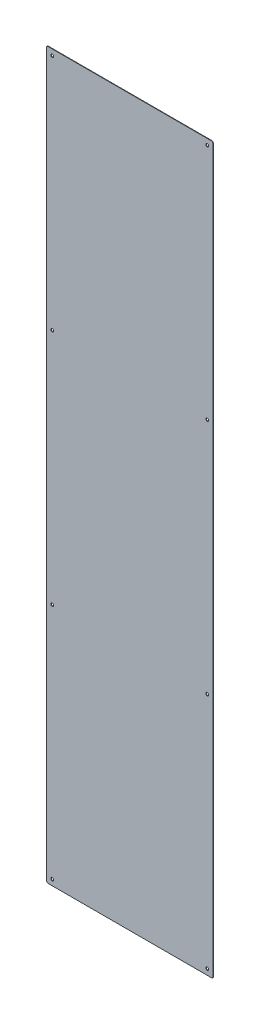
ISO-10303-21;
HEADER;
FILE_DESCRIPTION(('STEP AP214'),'2;1');
FILE_NAME('part.step','',(''),(''),'','','');
FILE_SCHEMA(('AUTOMOTIVE_DESIGN { 1 0 10303 214 1 1 1 1 }'));
ENDSEC;
DATA;
#1=APPLICATION_CONTEXT('core data for automotive mechanical design processes');
#2=APPLICATION_PROTOCOL_DEFINITION('international standard','automotive_design',2000,#1);
#3=PRODUCT_CONTEXT('',#1,'mechanical');
#4=PRODUCT('Part','Part','',(#3));
#5=PRODUCT_RELATED_PRODUCT_CATEGORY('part','',(#4));
#6=PRODUCT_DEFINITION_FORMATION('','',#4);
#7=PRODUCT_DEFINITION_CONTEXT('part definition',#1,'design');
#8=PRODUCT_DEFINITION('design','',#6,#7);
#9=PRODUCT_DEFINITION_SHAPE('','',#8);
#10=(LENGTH_UNIT() NAMED_UNIT(*) SI_UNIT(.MILLI.,.METRE.));
#11=(NAMED_UNIT(*) PLANE_ANGLE_UNIT() SI_UNIT($,.RADIAN.));
#12=(NAMED_UNIT(*) SI_UNIT($,.STERADIAN.) SOLID_ANGLE_UNIT());
#13=UNCERTAINTY_MEASURE_WITH_UNIT(LENGTH_MEASURE(1.E-05),#10,'distance_accuracy_value','');
#14=(GEOMETRIC_REPRESENTATION_CONTEXT(3) GLOBAL_UNCERTAINTY_ASSIGNED_CONTEXT((#13)) GLOBAL_UNIT_ASSIGNED_CONTEXT((#10,
#11,#12)) REPRESENTATION_CONTEXT('',''));
#15=CARTESIAN_POINT('',(0.,0.,0.));
#16=DIRECTION('',(0.,0.,1.));
#17=DIRECTION('',(1.,0.,0.));
#18=AXIS2_PLACEMENT_3D('',#15,#16,#17);
#19=CARTESIAN_POINT('',(172.5,793.500000000001,-0.000999999999999916));
#20=DIRECTION('',(0.,0.,1.));
#21=DIRECTION('',(1.,0.,0.));
#22=AXIS2_PLACEMENT_3D('',#19,#20,#21);
#23=CYLINDRICAL_SURFACE('',#22,3.25000000000013);
#24=CARTESIAN_POINT('',(172.5,793.500000000001,1.));
#25=DIRECTION('',(0.,0.,1.));
#26=DIRECTION('',(-1.,0.,0.));
#27=AXIS2_PLACEMENT_3D('',#24,#25,#26);
#28=CIRCLE('',#27,3.25000000000013);
#29=CARTESIAN_POINT('',(169.25,793.500000000001,1.));
#30=VERTEX_POINT('',#29);
#31=EDGE_CURVE('E163',#30,#30,#28,.T.);
#32=ORIENTED_EDGE('',*,*,#31,.T.);
#33=EDGE_LOOP('',(#32));
#34=FACE_BOUND('',#33,.T.);
#35=CARTESIAN_POINT('',(172.5,793.500000000001,0.));
#36=DIRECTION('',(0.,0.,1.));
#37=DIRECTION('',(1.,0.,0.));
#38=AXIS2_PLACEMENT_3D('',#35,#36,#37);
#39=CIRCLE('',#38,3.25000000000013);
#40=CARTESIAN_POINT('',(175.75,793.500000000001,0.));
#41=VERTEX_POINT('',#40);
#42=EDGE_CURVE('E166',#41,#41,#39,.F.);
#43=ORIENTED_EDGE('',*,*,#42,.T.);
#44=EDGE_LOOP('',(#43));
#45=FACE_BOUND('',#44,.T.);
#46=ADVANCED_FACE('F34',(#34,#45),#23,.F.);
#47=CARTESIAN_POINT('',(172.5,264.5,-0.000999999999999916));
#48=DIRECTION('',(0.,0.,1.));
#49=DIRECTION('',(1.,0.,0.));
#50=AXIS2_PLACEMENT_3D('',#47,#48,#49);
#51=CYLINDRICAL_SURFACE('',#50,3.25000000000013);
#52=CARTESIAN_POINT('',(172.5,264.5,1.));
#53=DIRECTION('',(0.,0.,1.));
#54=DIRECTION('',(-1.,0.,0.));
#55=AXIS2_PLACEMENT_3D('',#52,#53,#54);
#56=CIRCLE('',#55,3.25000000000013);
#57=CARTESIAN_POINT('',(169.25,264.5,1.));
#58=VERTEX_POINT('',#57);
#59=EDGE_CURVE('E157',#58,#58,#56,.T.);
#60=ORIENTED_EDGE('',*,*,#59,.T.);
#61=EDGE_LOOP('',(#60));
#62=FACE_BOUND('',#61,.T.);
#63=CARTESIAN_POINT('',(172.5,264.5,0.));
#64=DIRECTION('',(0.,0.,1.));
#65=DIRECTION('',(1.,0.,0.));
#66=AXIS2_PLACEMENT_3D('',#63,#64,#65);
#67=CIRCLE('',#66,3.25000000000013);
#68=CARTESIAN_POINT('',(175.75,264.5,0.));
#69=VERTEX_POINT('',#68);
#70=EDGE_CURVE('E160',#69,#69,#67,.F.);
#71=ORIENTED_EDGE('',*,*,#70,.T.);
#72=EDGE_LOOP('',(#71));
#73=FACE_BOUND('',#72,.T.);
#74=ADVANCED_FACE('F260',(#62,#73),#51,.F.);
#75=CARTESIAN_POINT('',(-172.5,793.500000000001,-0.000999999999999916));
#76=DIRECTION('',(0.,0.,1.));
#77=DIRECTION('',(1.,0.,0.));
#78=AXIS2_PLACEMENT_3D('',#75,#76,#77);
#79=CYLINDRICAL_SURFACE('',#78,3.25000000000013);
#80=CARTESIAN_POINT('',(-172.5,793.500000000001,1.));
#81=DIRECTION('',(0.,0.,1.));
#82=DIRECTION('',(1.,0.,0.));
#83=AXIS2_PLACEMENT_3D('',#80,#81,#82);
#84=CIRCLE('',#83,3.25000000000013);
#85=CARTESIAN_POINT('',(-169.25,793.500000000001,1.));
#86=VERTEX_POINT('',#85);
#87=EDGE_CURVE('E151',#86,#86,#84,.T.);
#88=ORIENTED_EDGE('',*,*,#87,.T.);
#89=EDGE_LOOP('',(#88));
#90=FACE_BOUND('',#89,.T.);
#91=CARTESIAN_POINT('',(-172.5,793.500000000001,0.));
#92=DIRECTION('',(0.,0.,1.));
#93=DIRECTION('',(1.,0.,0.));
#94=AXIS2_PLACEMENT_3D('',#91,#92,#93);
#95=CIRCLE('',#94,3.25000000000013);
#96=CARTESIAN_POINT('',(-169.25,793.500000000001,0.));
#97=VERTEX_POINT('',#96);
#98=EDGE_CURVE('E154',#97,#97,#95,.F.);
#99=ORIENTED_EDGE('',*,*,#98,.T.);
#100=EDGE_LOOP('',(#99));
#101=FACE_BOUND('',#100,.T.);
#102=ADVANCED_FACE('F266',(#90,#101),#79,.F.);
#103=CARTESIAN_POINT('',(-172.5,264.5,-0.000999999999999916));
#104=DIRECTION('',(0.,0.,1.));
#105=DIRECTION('',(1.,0.,0.));
#106=AXIS2_PLACEMENT_3D('',#103,#104,#105);
#107=CYLINDRICAL_SURFACE('',#106,3.25000000000013);
#108=CARTESIAN_POINT('',(-172.5,264.5,1.));
#109=DIRECTION('',(0.,0.,1.));
#110=DIRECTION('',(1.,0.,0.));
#111=AXIS2_PLACEMENT_3D('',#108,#109,#110);
#112=CIRCLE('',#111,3.25000000000013);
#113=CARTESIAN_POINT('',(-169.25,264.5,1.));
#114=VERTEX_POINT('',#113);
#115=EDGE_CURVE('E145',#114,#114,#112,.T.);
#116=ORIENTED_EDGE('',*,*,#115,.T.);
#117=EDGE_LOOP('',(#116));
#118=FACE_BOUND('',#117,.T.);
#119=CARTESIAN_POINT('',(-172.5,264.5,0.));
#120=DIRECTION('',(0.,0.,1.));
#121=DIRECTION('',(1.,0.,0.));
#122=AXIS2_PLACEMENT_3D('',#119,#120,#121);
#123=CIRCLE('',#122,3.25000000000013);
#124=CARTESIAN_POINT('',(-169.25,264.5,0.));
#125=VERTEX_POINT('',#124);
#126=EDGE_CURVE('E148',#125,#125,#123,.F.);
#127=ORIENTED_EDGE('',*,*,#126,.T.);
#128=EDGE_LOOP('',(#127));
#129=FACE_BOUND('',#128,.T.);
#130=ADVANCED_FACE('F344',(#118,#129),#107,.F.);
#131=CARTESIAN_POINT('',(185.,806.5,1.));
#132=DIRECTION('',(-1.,0.,0.));
#133=DIRECTION('',(0.,-1.,0.));
#134=AXIS2_PLACEMENT_3D('',#131,#132,#133);
#135=PLANE('',#134);
#136=DIRECTION('',(0.,1.,0.));
#137=VECTOR('',#136,1.);
#138=CARTESIAN_POINT('',(185.,806.5,1.));
#139=LINE('',#138,#137);
#140=CARTESIAN_POINT('',(185.,-803.5,1.));
#141=VERTEX_POINT('',#140);
#142=CARTESIAN_POINT('',(185.,803.5,1.));
#143=VERTEX_POINT('',#142);
#144=EDGE_CURVE('E121',#141,#143,#139,.T.);
#145=ORIENTED_EDGE('',*,*,#144,.F.);
#146=DIRECTION('',(0.,0.,-1.));
#147=VECTOR('',#146,1.);
#148=CARTESIAN_POINT('',(185.,-803.5,1.));
#149=LINE('',#148,#147);
#150=CARTESIAN_POINT('',(185.,-803.5,0.));
#151=VERTEX_POINT('',#150);
#152=EDGE_CURVE('E105',#141,#151,#149,.T.);
#153=ORIENTED_EDGE('',*,*,#152,.T.);
#154=DIRECTION('',(0.,1.,0.));
#155=VECTOR('',#154,1.);
#156=CARTESIAN_POINT('',(185.,806.5,0.));
#157=LINE('',#156,#155);
#158=CARTESIAN_POINT('',(185.,803.5,0.));
#159=VERTEX_POINT('',#158);
#160=EDGE_CURVE('E118',#151,#159,#157,.T.);
#161=ORIENTED_EDGE('',*,*,#160,.T.);
#162=DIRECTION('',(0.,0.,-1.));
#163=VECTOR('',#162,1.);
#164=CARTESIAN_POINT('',(185.,803.5,1.));
#165=LINE('',#164,#163);
#166=EDGE_CURVE('E123',#159,#143,#165,.F.);
#167=ORIENTED_EDGE('',*,*,#166,.T.);
#168=EDGE_LOOP('',(#145,#153,#161,#167));
#169=FACE_BOUND('',#168,.T.);
#170=ADVANCED_FACE('F117',(#169),#135,.F.);
#171=CARTESIAN_POINT('',(-185.,806.5,1.));
#172=DIRECTION('',(0.,-1.,0.));
#173=DIRECTION('',(0.,0.,-1.));
#174=AXIS2_PLACEMENT_3D('',#171,#172,#173);
#175=PLANE('',#174);
#176=DIRECTION('',(-1.,0.,0.));
#177=VECTOR('',#176,1.);
#178=CARTESIAN_POINT('',(-185.,806.5,1.));
#179=LINE('',#178,#177);
#180=CARTESIAN_POINT('',(182.,806.5,1.));
#181=VERTEX_POINT('',#180);
#182=CARTESIAN_POINT('',(-182.,806.5,1.));
#183=VERTEX_POINT('',#182);
#184=EDGE_CURVE('E190',#181,#183,#179,.T.);
#185=ORIENTED_EDGE('',*,*,#184,.F.);
#186=DIRECTION('',(0.,0.,-1.));
#187=VECTOR('',#186,1.);
#188=CARTESIAN_POINT('',(182.,806.5,1.));
#189=LINE('',#188,#187);
#190=CARTESIAN_POINT('',(182.,806.5,0.));
#191=VERTEX_POINT('',#190);
#192=EDGE_CURVE('E11',#181,#191,#189,.T.);
#193=ORIENTED_EDGE('',*,*,#192,.T.);
#194=DIRECTION('',(-1.,0.,0.));
#195=VECTOR('',#194,1.);
#196=CARTESIAN_POINT('',(-185.,806.5,0.));
#197=LINE('',#196,#195);
#198=CARTESIAN_POINT('',(-182.,806.5,0.));
#199=VERTEX_POINT('',#198);
#200=EDGE_CURVE('E129',#191,#199,#197,.T.);
#201=ORIENTED_EDGE('',*,*,#200,.T.);
#202=DIRECTION('',(0.,0.,-1.));
#203=VECTOR('',#202,1.);
#204=CARTESIAN_POINT('',(-182.,806.5,1.));
#205=LINE('',#204,#203);
#206=EDGE_CURVE('E42',#199,#183,#205,.F.);
#207=ORIENTED_EDGE('',*,*,#206,.T.);
#208=EDGE_LOOP('',(#185,#193,#201,#207));
#209=FACE_BOUND('',#208,.T.);
#210=ADVANCED_FACE('F189',(#209),#175,.F.);
#211=CARTESIAN_POINT('',(-185.,806.5,1.));
#212=DIRECTION('',(1.,0.,0.));
#213=DIRECTION('',(0.,1.,0.));
#214=AXIS2_PLACEMENT_3D('',#211,#212,#213);
#215=PLANE('',#214);
#216=DIRECTION('',(0.,-1.,0.));
#217=VECTOR('',#216,1.);
#218=CARTESIAN_POINT('',(-185.,806.5,0.));
#219=LINE('',#218,#217);
#220=CARTESIAN_POINT('',(-185.,803.5,0.));
#221=VERTEX_POINT('',#220);
#222=CARTESIAN_POINT('',(-185.,-803.5,0.));
#223=VERTEX_POINT('',#222);
#224=EDGE_CURVE('E133',#221,#223,#219,.T.);
#225=ORIENTED_EDGE('',*,*,#224,.T.);
#226=DIRECTION('',(0.,0.,-1.));
#227=VECTOR('',#226,1.);
#228=CARTESIAN_POINT('',(-185.,-803.5,1.));
#229=LINE('',#228,#227);
#230=CARTESIAN_POINT('',(-185.,-803.5,1.));
#231=VERTEX_POINT('',#230);
#232=EDGE_CURVE('E49',#223,#231,#229,.F.);
#233=ORIENTED_EDGE('',*,*,#232,.T.);
#234=DIRECTION('',(0.,-1.,0.));
#235=VECTOR('',#234,1.);
#236=CARTESIAN_POINT('',(-185.,806.5,1.));
#237=LINE('',#236,#235);
#238=CARTESIAN_POINT('',(-185.,803.5,1.));
#239=VERTEX_POINT('',#238);
#240=EDGE_CURVE('E197',#239,#231,#237,.T.);
#241=ORIENTED_EDGE('',*,*,#240,.F.);
#242=DIRECTION('',(0.,0.,-1.));
#243=VECTOR('',#242,1.);
#244=CARTESIAN_POINT('',(-185.,803.5,1.));
#245=LINE('',#244,#243);
#246=EDGE_CURVE('E183',#239,#221,#245,.T.);
#247=ORIENTED_EDGE('',*,*,#246,.T.);
#248=EDGE_LOOP('',(#225,#233,#241,#247));
#249=FACE_BOUND('',#248,.T.);
#250=ADVANCED_FACE('F201',(#249),#215,.F.);
#251=CARTESIAN_POINT('',(-185.,-806.5,1.));
#252=DIRECTION('',(0.,1.,0.));
#253=DIRECTION('',(0.,0.,1.));
#254=AXIS2_PLACEMENT_3D('',#251,#252,#253);
#255=PLANE('',#254);
#256=DIRECTION('',(1.,0.,0.));
#257=VECTOR('',#256,1.);
#258=CARTESIAN_POINT('',(-185.,-806.5,0.));
#259=LINE('',#258,#257);
#260=CARTESIAN_POINT('',(-182.,-806.5,0.));
#261=VERTEX_POINT('',#260);
#262=CARTESIAN_POINT('',(182.,-806.5,0.));
#263=VERTEX_POINT('',#262);
#264=EDGE_CURVE('E143',#261,#263,#259,.T.);
#265=ORIENTED_EDGE('',*,*,#264,.T.);
#266=DIRECTION('',(0.,0.,-1.));
#267=VECTOR('',#266,1.);
#268=CARTESIAN_POINT('',(182.,-806.5,1.));
#269=LINE('',#268,#267);
#270=CARTESIAN_POINT('',(182.,-806.5,1.));
#271=VERTEX_POINT('',#270);
#272=EDGE_CURVE('E106',#263,#271,#269,.F.);
#273=ORIENTED_EDGE('',*,*,#272,.T.);
#274=DIRECTION('',(1.,0.,0.));
#275=VECTOR('',#274,1.);
#276=CARTESIAN_POINT('',(-185.,-806.5,1.));
#277=LINE('',#276,#275);
#278=CARTESIAN_POINT('',(-182.,-806.5,1.));
#279=VERTEX_POINT('',#278);
#280=EDGE_CURVE('E139',#279,#271,#277,.T.);
#281=ORIENTED_EDGE('',*,*,#280,.F.);
#282=DIRECTION('',(0.,0.,-1.));
#283=VECTOR('',#282,1.);
#284=CARTESIAN_POINT('',(-182.,-806.5,1.));
#285=LINE('',#284,#283);
#286=EDGE_CURVE('E111',#279,#261,#285,.T.);
#287=ORIENTED_EDGE('',*,*,#286,.T.);
#288=EDGE_LOOP('',(#265,#273,#281,#287));
#289=FACE_BOUND('',#288,.T.);
#290=ADVANCED_FACE('F208',(#289),#255,.F.);
#291=CARTESIAN_POINT('',(0.,0.,1.));
#292=DIRECTION('',(0.,0.,1.));
#293=DIRECTION('',(1.,0.,0.));
#294=AXIS2_PLACEMENT_3D('',#291,#292,#293);
#295=PLANE('',#294);
#296=CARTESIAN_POINT('',(172.5,-264.5,1.));
#297=DIRECTION('',(0.,0.,1.));
#298=DIRECTION('',(-1.,0.,0.));
#299=AXIS2_PLACEMENT_3D('',#296,#297,#298);
#300=CIRCLE('',#299,3.25000000000013);
#301=CARTESIAN_POINT('',(169.25,-264.5,1.));
#302=VERTEX_POINT('',#301);
#303=EDGE_CURVE('E228',#302,#302,#300,.T.);
#304=ORIENTED_EDGE('',*,*,#303,.F.);
#305=EDGE_LOOP('',(#304));
#306=FACE_BOUND('',#305,.T.);
#307=CARTESIAN_POINT('',(-172.5,-264.5,1.));
#308=DIRECTION('',(0.,0.,1.));
#309=DIRECTION('',(1.,0.,0.));
#310=AXIS2_PLACEMENT_3D('',#307,#308,#309);
#311=CIRCLE('',#310,3.25000000000013);
#312=CARTESIAN_POINT('',(-169.25,-264.5,1.));
#313=VERTEX_POINT('',#312);
#314=EDGE_CURVE('E222',#313,#313,#311,.T.);
#315=ORIENTED_EDGE('',*,*,#314,.F.);
#316=EDGE_LOOP('',(#315));
#317=FACE_BOUND('',#316,.T.);
#318=CARTESIAN_POINT('',(-172.5,-793.5,1.));
#319=DIRECTION('',(0.,0.,1.));
#320=DIRECTION('',(1.,0.,0.));
#321=AXIS2_PLACEMENT_3D('',#318,#319,#320);
#322=CIRCLE('',#321,3.25000000000013);
#323=CARTESIAN_POINT('',(-169.25,-793.5,1.));
#324=VERTEX_POINT('',#323);
#325=EDGE_CURVE('E136',#324,#324,#322,.T.);
#326=ORIENTED_EDGE('',*,*,#325,.F.);
#327=EDGE_LOOP('',(#326));
#328=FACE_BOUND('',#327,.T.);
#329=CARTESIAN_POINT('',(172.5,-793.5,1.));
#330=DIRECTION('',(0.,0.,1.));
#331=DIRECTION('',(-1.,0.,0.));
#332=AXIS2_PLACEMENT_3D('',#329,#330,#331);
#333=CIRCLE('',#332,3.25000000000013);
#334=CARTESIAN_POINT('',(169.25,-793.5,1.));
#335=VERTEX_POINT('',#334);
#336=EDGE_CURVE('E214',#335,#335,#333,.T.);
#337=ORIENTED_EDGE('',*,*,#336,.F.);
#338=EDGE_LOOP('',(#337));
#339=FACE_BOUND('',#338,.T.);
#340=ORIENTED_EDGE('',*,*,#280,.T.);
#341=CARTESIAN_POINT('',(182.,-803.5,1.));
#342=DIRECTION('',(0.,0.,1.));
#343=DIRECTION('',(1.,0.,0.));
#344=AXIS2_PLACEMENT_3D('',#341,#342,#343);
#345=CIRCLE('',#344,3.);
#346=EDGE_CURVE('E181',#271,#141,#345,.T.);
#347=ORIENTED_EDGE('',*,*,#346,.T.);
#348=ORIENTED_EDGE('',*,*,#144,.T.);
#349=CARTESIAN_POINT('',(182.,803.5,1.));
#350=DIRECTION('',(0.,0.,1.));
#351=DIRECTION('',(1.,0.,0.));
#352=AXIS2_PLACEMENT_3D('',#349,#350,#351);
#353=CIRCLE('',#352,3.);
#354=EDGE_CURVE('E177',#143,#181,#353,.T.);
#355=ORIENTED_EDGE('',*,*,#354,.T.);
#356=ORIENTED_EDGE('',*,*,#184,.T.);
#357=CARTESIAN_POINT('',(-182.,803.5,1.));
#358=DIRECTION('',(0.,0.,1.));
#359=DIRECTION('',(1.,0.,0.));
#360=AXIS2_PLACEMENT_3D('',#357,#358,#359);
#361=CIRCLE('',#360,3.);
#362=EDGE_CURVE('E56',#183,#239,#361,.T.);
#363=ORIENTED_EDGE('',*,*,#362,.T.);
#364=ORIENTED_EDGE('',*,*,#240,.T.);
#365=CARTESIAN_POINT('',(-182.,-803.5,1.));
#366=DIRECTION('',(0.,0.,1.));
#367=DIRECTION('',(1.,0.,0.));
#368=AXIS2_PLACEMENT_3D('',#365,#366,#367);
#369=CIRCLE('',#368,3.);
#370=EDGE_CURVE('E179',#231,#279,#369,.T.);
#371=ORIENTED_EDGE('',*,*,#370,.T.);
#372=EDGE_LOOP('',(#340,#347,#348,#355,#356,#363,#364,#371));
#373=FACE_BOUND('',#372,.T.);
#374=ORIENTED_EDGE('',*,*,#115,.F.);
#375=EDGE_LOOP('',(#374));
#376=FACE_BOUND('',#375,.T.);
#377=ORIENTED_EDGE('',*,*,#87,.F.);
#378=EDGE_LOOP('',(#377));
#379=FACE_BOUND('',#378,.T.);
#380=ORIENTED_EDGE('',*,*,#59,.F.);
#381=EDGE_LOOP('',(#380));
#382=FACE_BOUND('',#381,.T.);
#383=ORIENTED_EDGE('',*,*,#31,.F.);
#384=EDGE_LOOP('',(#383));
#385=FACE_BOUND('',#384,.T.);
#386=ADVANCED_FACE('F194',(#306,#317,#328,#339,#373,#376,#379,#382,#385),#295,.T.);
#387=CARTESIAN_POINT('',(0.,0.,0.));
#388=DIRECTION('',(0.,0.,1.));
#389=DIRECTION('',(1.,0.,0.));
#390=AXIS2_PLACEMENT_3D('',#387,#388,#389);
#391=PLANE('',#390);
#392=CARTESIAN_POINT('',(172.5,-264.5,0.));
#393=DIRECTION('',(0.,0.,1.));
#394=DIRECTION('',(1.,0.,0.));
#395=AXIS2_PLACEMENT_3D('',#392,#393,#394);
#396=CIRCLE('',#395,3.25000000000013);
#397=CARTESIAN_POINT('',(175.75,-264.5,0.));
#398=VERTEX_POINT('',#397);
#399=EDGE_CURVE('E225',#398,#398,#396,.F.);
#400=ORIENTED_EDGE('',*,*,#399,.F.);
#401=EDGE_LOOP('',(#400));
#402=FACE_BOUND('',#401,.T.);
#403=CARTESIAN_POINT('',(-172.5,-264.5,0.));
#404=DIRECTION('',(0.,0.,1.));
#405=DIRECTION('',(1.,0.,0.));
#406=AXIS2_PLACEMENT_3D('',#403,#404,#405);
#407=CIRCLE('',#406,3.25000000000013);
#408=CARTESIAN_POINT('',(-169.25,-264.5,0.));
#409=VERTEX_POINT('',#408);
#410=EDGE_CURVE('E216',#409,#409,#407,.F.);
#411=ORIENTED_EDGE('',*,*,#410,.F.);
#412=EDGE_LOOP('',(#411));
#413=FACE_BOUND('',#412,.T.);
#414=CARTESIAN_POINT('',(-172.5,-793.5,0.));
#415=DIRECTION('',(0.,0.,1.));
#416=DIRECTION('',(1.,0.,0.));
#417=AXIS2_PLACEMENT_3D('',#414,#415,#416);
#418=CIRCLE('',#417,3.25000000000013);
#419=CARTESIAN_POINT('',(-169.25,-793.5,0.));
#420=VERTEX_POINT('',#419);
#421=EDGE_CURVE('E130',#420,#420,#418,.F.);
#422=ORIENTED_EDGE('',*,*,#421,.F.);
#423=EDGE_LOOP('',(#422));
#424=FACE_BOUND('',#423,.T.);
#425=CARTESIAN_POINT('',(172.5,-793.5,0.));
#426=DIRECTION('',(0.,0.,1.));
#427=DIRECTION('',(1.,0.,0.));
#428=AXIS2_PLACEMENT_3D('',#425,#426,#427);
#429=CIRCLE('',#428,3.25000000000013);
#430=CARTESIAN_POINT('',(175.75,-793.5,0.));
#431=VERTEX_POINT('',#430);
#432=EDGE_CURVE('E211',#431,#431,#429,.F.);
#433=ORIENTED_EDGE('',*,*,#432,.F.);
#434=EDGE_LOOP('',(#433));
#435=FACE_BOUND('',#434,.T.);
#436=ORIENTED_EDGE('',*,*,#160,.F.);
#437=CARTESIAN_POINT('',(182.,-803.5,0.));
#438=DIRECTION('',(0.,0.,1.));
#439=DIRECTION('',(1.,0.,0.));
#440=AXIS2_PLACEMENT_3D('',#437,#438,#439);
#441=CIRCLE('',#440,3.);
#442=EDGE_CURVE('E101',#151,#263,#441,.F.);
#443=ORIENTED_EDGE('',*,*,#442,.T.);
#444=ORIENTED_EDGE('',*,*,#264,.F.);
#445=CARTESIAN_POINT('',(-182.,-803.5,0.));
#446=DIRECTION('',(0.,0.,1.));
#447=DIRECTION('',(1.,0.,0.));
#448=AXIS2_PLACEMENT_3D('',#445,#446,#447);
#449=CIRCLE('',#448,3.);
#450=EDGE_CURVE('E112',#261,#223,#449,.F.);
#451=ORIENTED_EDGE('',*,*,#450,.T.);
#452=ORIENTED_EDGE('',*,*,#224,.F.);
#453=CARTESIAN_POINT('',(-182.,803.5,0.));
#454=DIRECTION('',(0.,0.,1.));
#455=DIRECTION('',(1.,0.,0.));
#456=AXIS2_PLACEMENT_3D('',#453,#454,#455);
#457=CIRCLE('',#456,3.);
#458=EDGE_CURVE('E122',#221,#199,#457,.F.);
#459=ORIENTED_EDGE('',*,*,#458,.T.);
#460=ORIENTED_EDGE('',*,*,#200,.F.);
#461=CARTESIAN_POINT('',(182.,803.5,0.));
#462=DIRECTION('',(0.,0.,1.));
#463=DIRECTION('',(1.,0.,0.));
#464=AXIS2_PLACEMENT_3D('',#461,#462,#463);
#465=CIRCLE('',#464,3.);
#466=EDGE_CURVE('E128',#191,#159,#465,.F.);
#467=ORIENTED_EDGE('',*,*,#466,.T.);
#468=EDGE_LOOP('',(#436,#443,#444,#451,#452,#459,#460,#467));
#469=FACE_BOUND('',#468,.T.);
#470=ORIENTED_EDGE('',*,*,#126,.F.);
#471=EDGE_LOOP('',(#470));
#472=FACE_BOUND('',#471,.T.);
#473=ORIENTED_EDGE('',*,*,#98,.F.);
#474=EDGE_LOOP('',(#473));
#475=FACE_BOUND('',#474,.T.);
#476=ORIENTED_EDGE('',*,*,#70,.F.);
#477=EDGE_LOOP('',(#476));
#478=FACE_BOUND('',#477,.T.);
#479=ORIENTED_EDGE('',*,*,#42,.F.);
#480=EDGE_LOOP('',(#479));
#481=FACE_BOUND('',#480,.T.);
#482=ADVANCED_FACE('F125',(#402,#413,#424,#435,#469,#472,#475,#478,#481),#391,.F.);
#483=CARTESIAN_POINT('',(172.5,-793.5,-0.000999999999999916));
#484=DIRECTION('',(0.,0.,1.));
#485=DIRECTION('',(1.,0.,0.));
#486=AXIS2_PLACEMENT_3D('',#483,#484,#485);
#487=CYLINDRICAL_SURFACE('',#486,3.25000000000013);
#488=ORIENTED_EDGE('',*,*,#336,.T.);
#489=EDGE_LOOP('',(#488));
#490=FACE_BOUND('',#489,.T.);
#491=ORIENTED_EDGE('',*,*,#432,.T.);
#492=EDGE_LOOP('',(#491));
#493=FACE_BOUND('',#492,.T.);
#494=ADVANCED_FACE('F244',(#490,#493),#487,.F.);
#495=CARTESIAN_POINT('',(-172.5,-793.5,-0.000999999999999916));
#496=DIRECTION('',(0.,0.,1.));
#497=DIRECTION('',(1.,0.,0.));
#498=AXIS2_PLACEMENT_3D('',#495,#496,#497);
#499=CYLINDRICAL_SURFACE('',#498,3.25000000000013);
#500=ORIENTED_EDGE('',*,*,#325,.T.);
#501=EDGE_LOOP('',(#500));
#502=FACE_BOUND('',#501,.T.);
#503=ORIENTED_EDGE('',*,*,#421,.T.);
#504=EDGE_LOOP('',(#503));
#505=FACE_BOUND('',#504,.T.);
#506=ADVANCED_FACE('F247',(#502,#505),#499,.F.);
#507=CARTESIAN_POINT('',(-172.5,-264.5,-0.000999999999999916));
#508=DIRECTION('',(0.,0.,1.));
#509=DIRECTION('',(1.,0.,0.));
#510=AXIS2_PLACEMENT_3D('',#507,#508,#509);
#511=CYLINDRICAL_SURFACE('',#510,3.25000000000013);
#512=ORIENTED_EDGE('',*,*,#314,.T.);
#513=EDGE_LOOP('',(#512));
#514=FACE_BOUND('',#513,.T.);
#515=ORIENTED_EDGE('',*,*,#410,.T.);
#516=EDGE_LOOP('',(#515));
#517=FACE_BOUND('',#516,.T.);
#518=ADVANCED_FACE('F352',(#514,#517),#511,.F.);
#519=CARTESIAN_POINT('',(172.5,-264.5,-0.000999999999999916));
#520=DIRECTION('',(0.,0.,1.));
#521=DIRECTION('',(1.,0.,0.));
#522=AXIS2_PLACEMENT_3D('',#519,#520,#521);
#523=CYLINDRICAL_SURFACE('',#522,3.25000000000013);
#524=ORIENTED_EDGE('',*,*,#303,.T.);
#525=EDGE_LOOP('',(#524));
#526=FACE_BOUND('',#525,.T.);
#527=ORIENTED_EDGE('',*,*,#399,.T.);
#528=EDGE_LOOP('',(#527));
#529=FACE_BOUND('',#528,.T.);
#530=ADVANCED_FACE('F232',(#526,#529),#523,.F.);
#531=CARTESIAN_POINT('',(182.,-803.5,1.));
#532=DIRECTION('',(0.,0.,-1.));
#533=DIRECTION('',(-1.,0.,0.));
#534=AXIS2_PLACEMENT_3D('',#531,#532,#533);
#535=CYLINDRICAL_SURFACE('',#534,3.);
#536=ORIENTED_EDGE('',*,*,#346,.F.);
#537=ORIENTED_EDGE('',*,*,#272,.F.);
#538=ORIENTED_EDGE('',*,*,#442,.F.);
#539=ORIENTED_EDGE('',*,*,#152,.F.);
#540=EDGE_LOOP('',(#536,#537,#538,#539));
#541=FACE_BOUND('',#540,.T.);
#542=ADVANCED_FACE('F104',(#541),#535,.T.);
#543=CARTESIAN_POINT('',(-182.,-803.5,1.));
#544=DIRECTION('',(0.,0.,-1.));
#545=DIRECTION('',(-1.,0.,0.));
#546=AXIS2_PLACEMENT_3D('',#543,#544,#545);
#547=CYLINDRICAL_SURFACE('',#546,3.);
#548=ORIENTED_EDGE('',*,*,#370,.F.);
#549=ORIENTED_EDGE('',*,*,#232,.F.);
#550=ORIENTED_EDGE('',*,*,#450,.F.);
#551=ORIENTED_EDGE('',*,*,#286,.F.);
#552=EDGE_LOOP('',(#548,#549,#550,#551));
#553=FACE_BOUND('',#552,.T.);
#554=ADVANCED_FACE('F205',(#553),#547,.T.);
#555=CARTESIAN_POINT('',(182.,803.5,1.));
#556=DIRECTION('',(0.,0.,-1.));
#557=DIRECTION('',(-1.,0.,0.));
#558=AXIS2_PLACEMENT_3D('',#555,#556,#557);
#559=CYLINDRICAL_SURFACE('',#558,3.);
#560=ORIENTED_EDGE('',*,*,#354,.F.);
#561=ORIENTED_EDGE('',*,*,#166,.F.);
#562=ORIENTED_EDGE('',*,*,#466,.F.);
#563=ORIENTED_EDGE('',*,*,#192,.F.);
#564=EDGE_LOOP('',(#560,#561,#562,#563));
#565=FACE_BOUND('',#564,.T.);
#566=ADVANCED_FACE('F275',(#565),#559,.T.);
#567=CARTESIAN_POINT('',(-182.,803.5,1.));
#568=DIRECTION('',(0.,0.,-1.));
#569=DIRECTION('',(-1.,0.,0.));
#570=AXIS2_PLACEMENT_3D('',#567,#568,#569);
#571=CYLINDRICAL_SURFACE('',#570,3.);
#572=ORIENTED_EDGE('',*,*,#362,.F.);
#573=ORIENTED_EDGE('',*,*,#206,.F.);
#574=ORIENTED_EDGE('',*,*,#458,.F.);
#575=ORIENTED_EDGE('',*,*,#246,.F.);
#576=EDGE_LOOP('',(#572,#573,#574,#575));
#577=FACE_BOUND('',#576,.T.);
#578=ADVANCED_FACE('F36',(#577),#571,.T.);
#579=CLOSED_SHELL('',(#46,#74,#102,#130,#170,#210,#250,#290,#386,#482,#494,#506,#518,#530,#542,
#554,#566,#578));
#580=MANIFOLD_SOLID_BREP('B2',#579);
#581=ADVANCED_BREP_SHAPE_REPRESENTATION('',(#18,#580),#14);
#582=SHAPE_DEFINITION_REPRESENTATION(#9,#581);
ENDSEC;
END-ISO-10303-21;
